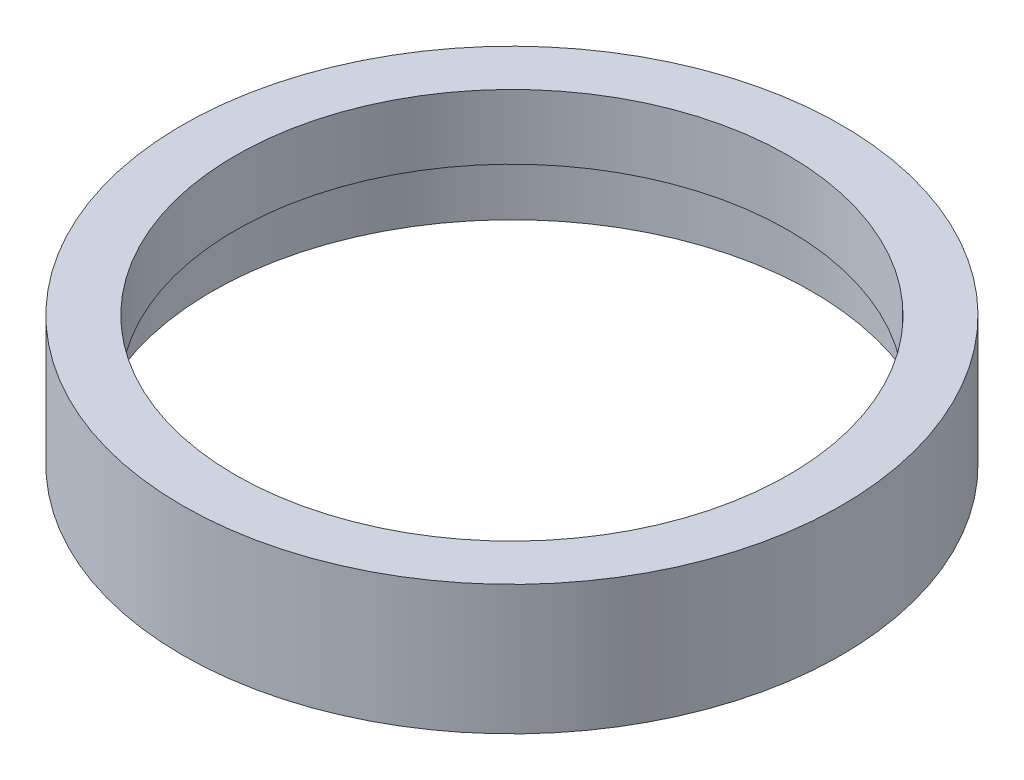
ISO-10303-21;
HEADER;
FILE_DESCRIPTION(('STEP AP214'),'2;1');
FILE_NAME('part.step','',(''),(''),'','','');
FILE_SCHEMA(('AUTOMOTIVE_DESIGN { 1 0 10303 214 1 1 1 1 }'));
ENDSEC;
DATA;
#1=APPLICATION_CONTEXT('core data for automotive mechanical design processes');
#2=APPLICATION_PROTOCOL_DEFINITION('international standard','automotive_design',2000,#1);
#3=PRODUCT_CONTEXT('',#1,'mechanical');
#4=PRODUCT('Part','Part','',(#3));
#5=PRODUCT_RELATED_PRODUCT_CATEGORY('part','',(#4));
#6=PRODUCT_DEFINITION_FORMATION('','',#4);
#7=PRODUCT_DEFINITION_CONTEXT('part definition',#1,'design');
#8=PRODUCT_DEFINITION('design','',#6,#7);
#9=PRODUCT_DEFINITION_SHAPE('','',#8);
#10=(LENGTH_UNIT() NAMED_UNIT(*) SI_UNIT(.MILLI.,.METRE.));
#11=(NAMED_UNIT(*) PLANE_ANGLE_UNIT() SI_UNIT($,.RADIAN.));
#12=(NAMED_UNIT(*) SI_UNIT($,.STERADIAN.) SOLID_ANGLE_UNIT());
#13=UNCERTAINTY_MEASURE_WITH_UNIT(LENGTH_MEASURE(1.E-05),#10,'distance_accuracy_value','');
#14=(GEOMETRIC_REPRESENTATION_CONTEXT(3) GLOBAL_UNCERTAINTY_ASSIGNED_CONTEXT((#13)) GLOBAL_UNIT_ASSIGNED_CONTEXT((#10,
#11,#12)) REPRESENTATION_CONTEXT('',''));
#15=CARTESIAN_POINT('',(0.,0.,0.));
#16=DIRECTION('',(0.,0.,1.));
#17=DIRECTION('',(1.,0.,0.));
#18=AXIS2_PLACEMENT_3D('',#15,#16,#17);
#19=CARTESIAN_POINT('',(28.,0.,0.));
#20=DIRECTION('',(0.,1.,0.));
#21=DIRECTION('',(0.,0.,1.));
#22=AXIS2_PLACEMENT_3D('',#19,#20,#21);
#23=PLANE('',#22);
#24=CARTESIAN_POINT('',(0.,0.,0.));
#25=DIRECTION('',(0.,1.,0.));
#26=DIRECTION('',(0.,0.,1.));
#27=AXIS2_PLACEMENT_3D('',#24,#25,#26);
#28=CIRCLE('',#27,28.);
#29=CARTESIAN_POINT('',(0.,0.,28.));
#30=VERTEX_POINT('',#29);
#31=EDGE_CURVE('E61',#30,#30,#28,.T.);
#32=ORIENTED_EDGE('',*,*,#31,.F.);
#33=EDGE_LOOP('',(#32));
#34=FACE_BOUND('',#33,.T.);
#35=CARTESIAN_POINT('',(0.,0.,0.));
#36=DIRECTION('',(0.,1.,0.));
#37=DIRECTION('',(0.,0.,1.));
#38=AXIS2_PLACEMENT_3D('',#35,#36,#37);
#39=CIRCLE('',#38,25.5);
#40=CARTESIAN_POINT('',(0.,0.,25.5));
#41=VERTEX_POINT('',#40);
#42=EDGE_CURVE('E10',#41,#41,#39,.T.);
#43=ORIENTED_EDGE('',*,*,#42,.T.);
#44=EDGE_LOOP('',(#43));
#45=FACE_BOUND('',#44,.T.);
#46=ADVANCED_FACE('F33',(#34,#45),#23,.F.);
#47=CARTESIAN_POINT('',(0.,60.0208204142554,0.));
#48=DIRECTION('',(0.,1.,0.));
#49=DIRECTION('',(0.,0.,1.));
#50=AXIS2_PLACEMENT_3D('',#47,#48,#49);
#51=CYLINDRICAL_SURFACE('',#50,25.5);
#52=ORIENTED_EDGE('',*,*,#42,.F.);
#53=EDGE_LOOP('',(#52));
#54=FACE_BOUND('',#53,.T.);
#55=CARTESIAN_POINT('',(0.,4.5,0.));
#56=DIRECTION('',(0.,1.,0.));
#57=DIRECTION('',(0.,0.,1.));
#58=AXIS2_PLACEMENT_3D('',#55,#56,#57);
#59=CIRCLE('',#58,25.5);
#60=CARTESIAN_POINT('',(0.,4.5,25.5));
#61=VERTEX_POINT('',#60);
#62=EDGE_CURVE('E39',#61,#61,#59,.T.);
#63=ORIENTED_EDGE('',*,*,#62,.T.);
#64=EDGE_LOOP('',(#63));
#65=FACE_BOUND('',#64,.T.);
#66=ADVANCED_FACE('F68',(#54,#65),#51,.F.);
#67=CARTESIAN_POINT('',(25.5,4.5,0.));
#68=DIRECTION('',(0.,-1.,0.));
#69=DIRECTION('',(0.,0.,-1.));
#70=AXIS2_PLACEMENT_3D('',#67,#68,#69);
#71=PLANE('',#70);
#72=ORIENTED_EDGE('',*,*,#62,.F.);
#73=EDGE_LOOP('',(#72));
#74=FACE_BOUND('',#73,.T.);
#75=CARTESIAN_POINT('',(0.,4.5,0.));
#76=DIRECTION('',(0.,1.,0.));
#77=DIRECTION('',(0.,0.,1.));
#78=AXIS2_PLACEMENT_3D('',#75,#76,#77);
#79=CIRCLE('',#78,26.1);
#80=CARTESIAN_POINT('',(0.,4.5,26.1));
#81=VERTEX_POINT('',#80);
#82=EDGE_CURVE('E43',#81,#81,#79,.T.);
#83=ORIENTED_EDGE('',*,*,#82,.T.);
#84=EDGE_LOOP('',(#83));
#85=FACE_BOUND('',#84,.T.);
#86=ADVANCED_FACE('F72',(#74,#85),#71,.F.);
#87=CARTESIAN_POINT('',(0.,60.0208204142554,0.));
#88=DIRECTION('',(0.,1.,0.));
#89=DIRECTION('',(0.,0.,1.));
#90=AXIS2_PLACEMENT_3D('',#87,#88,#89);
#91=CYLINDRICAL_SURFACE('',#90,26.1);
#92=ORIENTED_EDGE('',*,*,#82,.F.);
#93=EDGE_LOOP('',(#92));
#94=FACE_BOUND('',#93,.T.);
#95=CARTESIAN_POINT('',(0.,5.5,0.));
#96=DIRECTION('',(0.,1.,0.));
#97=DIRECTION('',(0.,0.,1.));
#98=AXIS2_PLACEMENT_3D('',#95,#96,#97);
#99=CIRCLE('',#98,26.1);
#100=CARTESIAN_POINT('',(0.,5.5,26.1));
#101=VERTEX_POINT('',#100);
#102=EDGE_CURVE('E47',#101,#101,#99,.T.);
#103=ORIENTED_EDGE('',*,*,#102,.T.);
#104=EDGE_LOOP('',(#103));
#105=FACE_BOUND('',#104,.T.);
#106=ADVANCED_FACE('F77',(#94,#105),#91,.F.);
#107=CARTESIAN_POINT('',(26.1,5.5,0.));
#108=DIRECTION('',(0.,1.,0.));
#109=DIRECTION('',(0.,0.,1.));
#110=AXIS2_PLACEMENT_3D('',#107,#108,#109);
#111=PLANE('',#110);
#112=ORIENTED_EDGE('',*,*,#102,.F.);
#113=EDGE_LOOP('',(#112));
#114=FACE_BOUND('',#113,.T.);
#115=CARTESIAN_POINT('',(0.,5.5,0.));
#116=DIRECTION('',(0.,1.,0.));
#117=DIRECTION('',(0.,0.,1.));
#118=AXIS2_PLACEMENT_3D('',#115,#116,#117);
#119=CIRCLE('',#118,23.5);
#120=CARTESIAN_POINT('',(0.,5.5,23.5));
#121=VERTEX_POINT('',#120);
#122=EDGE_CURVE('E52',#121,#121,#119,.T.);
#123=ORIENTED_EDGE('',*,*,#122,.T.);
#124=EDGE_LOOP('',(#123));
#125=FACE_BOUND('',#124,.T.);
#126=ADVANCED_FACE('F83',(#114,#125),#111,.F.);
#127=CARTESIAN_POINT('',(0.,60.0208204142554,0.));
#128=DIRECTION('',(0.,1.,0.));
#129=DIRECTION('',(0.,0.,1.));
#130=AXIS2_PLACEMENT_3D('',#127,#128,#129);
#131=CYLINDRICAL_SURFACE('',#130,23.5);
#132=ORIENTED_EDGE('',*,*,#122,.F.);
#133=EDGE_LOOP('',(#132));
#134=FACE_BOUND('',#133,.T.);
#135=CARTESIAN_POINT('',(0.,11.,0.));
#136=DIRECTION('',(0.,1.,0.));
#137=DIRECTION('',(0.,0.,1.));
#138=AXIS2_PLACEMENT_3D('',#135,#136,#137);
#139=CIRCLE('',#138,23.5);
#140=CARTESIAN_POINT('',(0.,11.,23.5));
#141=VERTEX_POINT('',#140);
#142=EDGE_CURVE('E55',#141,#141,#139,.T.);
#143=ORIENTED_EDGE('',*,*,#142,.T.);
#144=EDGE_LOOP('',(#143));
#145=FACE_BOUND('',#144,.T.);
#146=ADVANCED_FACE('F87',(#134,#145),#131,.F.);
#147=CARTESIAN_POINT('',(23.5,11.,0.));
#148=DIRECTION('',(0.,-1.,0.));
#149=DIRECTION('',(0.,0.,-1.));
#150=AXIS2_PLACEMENT_3D('',#147,#148,#149);
#151=PLANE('',#150);
#152=ORIENTED_EDGE('',*,*,#142,.F.);
#153=EDGE_LOOP('',(#152));
#154=FACE_BOUND('',#153,.T.);
#155=CARTESIAN_POINT('',(0.,11.,0.));
#156=DIRECTION('',(0.,1.,0.));
#157=DIRECTION('',(0.,0.,1.));
#158=AXIS2_PLACEMENT_3D('',#155,#156,#157);
#159=CIRCLE('',#158,28.);
#160=CARTESIAN_POINT('',(0.,11.,28.));
#161=VERTEX_POINT('',#160);
#162=EDGE_CURVE('E58',#161,#161,#159,.T.);
#163=ORIENTED_EDGE('',*,*,#162,.T.);
#164=EDGE_LOOP('',(#163));
#165=FACE_BOUND('',#164,.T.);
#166=ADVANCED_FACE('F91',(#154,#165),#151,.F.);
#167=CARTESIAN_POINT('',(0.,60.0208204142554,0.));
#168=DIRECTION('',(0.,1.,0.));
#169=DIRECTION('',(0.,0.,1.));
#170=AXIS2_PLACEMENT_3D('',#167,#168,#169);
#171=CYLINDRICAL_SURFACE('',#170,28.);
#172=ORIENTED_EDGE('',*,*,#162,.F.);
#173=EDGE_LOOP('',(#172));
#174=FACE_BOUND('',#173,.T.);
#175=ORIENTED_EDGE('',*,*,#31,.T.);
#176=EDGE_LOOP('',(#175));
#177=FACE_BOUND('',#176,.T.);
#178=ADVANCED_FACE('F65',(#174,#177),#171,.T.);
#179=CLOSED_SHELL('',(#46,#66,#86,#106,#126,#146,#166,#178));
#180=MANIFOLD_SOLID_BREP('B2',#179);
#181=ADVANCED_BREP_SHAPE_REPRESENTATION('',(#18,#180),#14);
#182=SHAPE_DEFINITION_REPRESENTATION(#9,#181);
ENDSEC;
END-ISO-10303-21;
